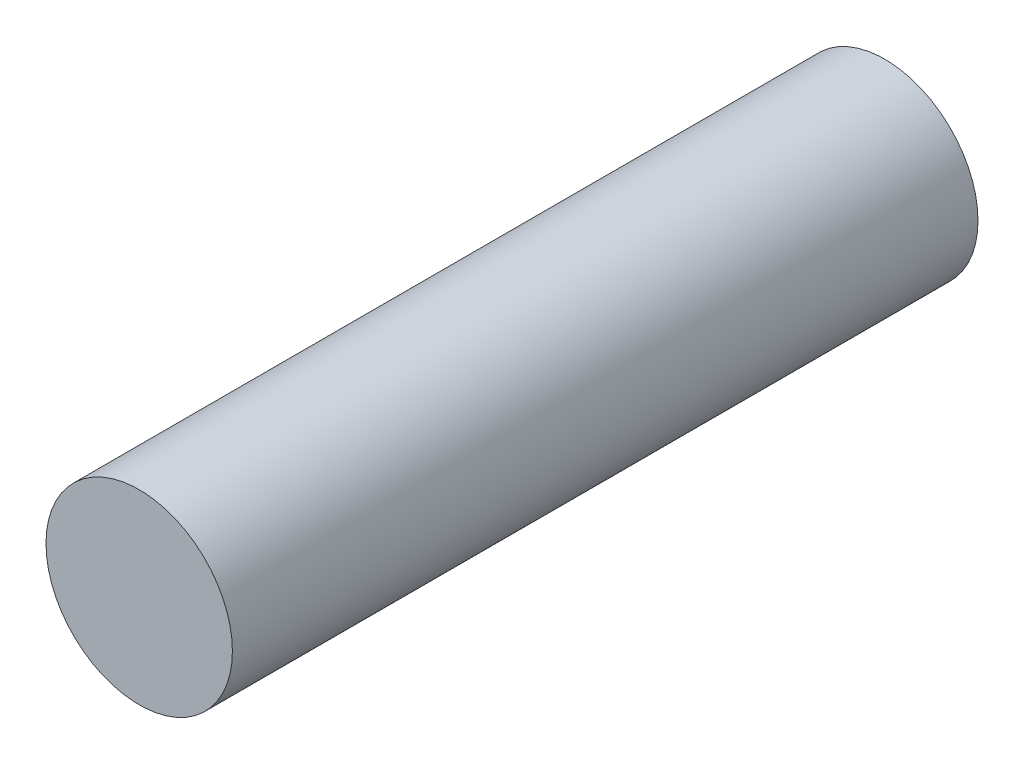
ISO-10303-21;
HEADER;
FILE_DESCRIPTION(('STEP AP214'),'2;1');
FILE_NAME('part.step','',(''),(''),'','','');
FILE_SCHEMA(('AUTOMOTIVE_DESIGN { 1 0 10303 214 1 1 1 1 }'));
ENDSEC;
DATA;
#1=APPLICATION_CONTEXT('core data for automotive mechanical design processes');
#2=APPLICATION_PROTOCOL_DEFINITION('international standard','automotive_design',2000,#1);
#3=PRODUCT_CONTEXT('',#1,'mechanical');
#4=PRODUCT('Part','Part','',(#3));
#5=PRODUCT_RELATED_PRODUCT_CATEGORY('part','',(#4));
#6=PRODUCT_DEFINITION_FORMATION('','',#4);
#7=PRODUCT_DEFINITION_CONTEXT('part definition',#1,'design');
#8=PRODUCT_DEFINITION('design','',#6,#7);
#9=PRODUCT_DEFINITION_SHAPE('','',#8);
#10=(LENGTH_UNIT() NAMED_UNIT(*) SI_UNIT(.MILLI.,.METRE.));
#11=(NAMED_UNIT(*) PLANE_ANGLE_UNIT() SI_UNIT($,.RADIAN.));
#12=(NAMED_UNIT(*) SI_UNIT($,.STERADIAN.) SOLID_ANGLE_UNIT());
#13=UNCERTAINTY_MEASURE_WITH_UNIT(LENGTH_MEASURE(1.E-05),#10,'distance_accuracy_value','');
#14=(GEOMETRIC_REPRESENTATION_CONTEXT(3) GLOBAL_UNCERTAINTY_ASSIGNED_CONTEXT((#13)) GLOBAL_UNIT_ASSIGNED_CONTEXT((#10,
#11,#12)) REPRESENTATION_CONTEXT('',''));
#15=CARTESIAN_POINT('',(0.,0.,0.));
#16=DIRECTION('',(0.,0.,1.));
#17=DIRECTION('',(1.,0.,0.));
#18=AXIS2_PLACEMENT_3D('',#15,#16,#17);
#19=CARTESIAN_POINT('',(0.,0.,3.));
#20=DIRECTION('',(0.,0.,-1.));
#21=DIRECTION('',(-1.,0.,0.));
#22=AXIS2_PLACEMENT_3D('',#19,#20,#21);
#23=CYLINDRICAL_SURFACE('',#22,0.75);
#24=CARTESIAN_POINT('',(0.,0.,3.));
#25=DIRECTION('',(0.,0.,1.));
#26=DIRECTION('',(1.,0.,0.));
#27=AXIS2_PLACEMENT_3D('',#24,#25,#26);
#28=CIRCLE('',#27,0.75);
#29=CARTESIAN_POINT('',(0.75,0.,3.));
#30=VERTEX_POINT('',#29);
#31=EDGE_CURVE('E10',#30,#30,#28,.T.);
#32=ORIENTED_EDGE('',*,*,#31,.F.);
#33=EDGE_LOOP('',(#32));
#34=FACE_BOUND('',#33,.T.);
#35=CARTESIAN_POINT('',(0.,0.,-3.));
#36=DIRECTION('',(0.,0.,1.));
#37=DIRECTION('',(1.,0.,0.));
#38=AXIS2_PLACEMENT_3D('',#35,#36,#37);
#39=CIRCLE('',#38,0.75);
#40=CARTESIAN_POINT('',(0.75,0.,-3.));
#41=VERTEX_POINT('',#40);
#42=EDGE_CURVE('E34',#41,#41,#39,.T.);
#43=ORIENTED_EDGE('',*,*,#42,.T.);
#44=EDGE_LOOP('',(#43));
#45=FACE_BOUND('',#44,.T.);
#46=ADVANCED_FACE('F31',(#34,#45),#23,.T.);
#47=CARTESIAN_POINT('',(0.,0.,3.));
#48=DIRECTION('',(0.,0.,1.));
#49=DIRECTION('',(1.,0.,0.));
#50=AXIS2_PLACEMENT_3D('',#47,#48,#49);
#51=PLANE('',#50);
#52=ORIENTED_EDGE('',*,*,#31,.T.);
#53=EDGE_LOOP('',(#52));
#54=FACE_BOUND('',#53,.T.);
#55=ADVANCED_FACE('F46',(#54),#51,.T.);
#56=CARTESIAN_POINT('',(0.,0.,-3.));
#57=DIRECTION('',(0.,0.,1.));
#58=DIRECTION('',(1.,0.,0.));
#59=AXIS2_PLACEMENT_3D('',#56,#57,#58);
#60=PLANE('',#59);
#61=ORIENTED_EDGE('',*,*,#42,.F.);
#62=EDGE_LOOP('',(#61));
#63=FACE_BOUND('',#62,.T.);
#64=ADVANCED_FACE('F44',(#63),#60,.F.);
#65=CLOSED_SHELL('',(#46,#55,#64));
#66=MANIFOLD_SOLID_BREP('B2',#65);
#67=ADVANCED_BREP_SHAPE_REPRESENTATION('',(#18,#66),#14);
#68=SHAPE_DEFINITION_REPRESENTATION(#9,#67);
ENDSEC;
END-ISO-10303-21;
